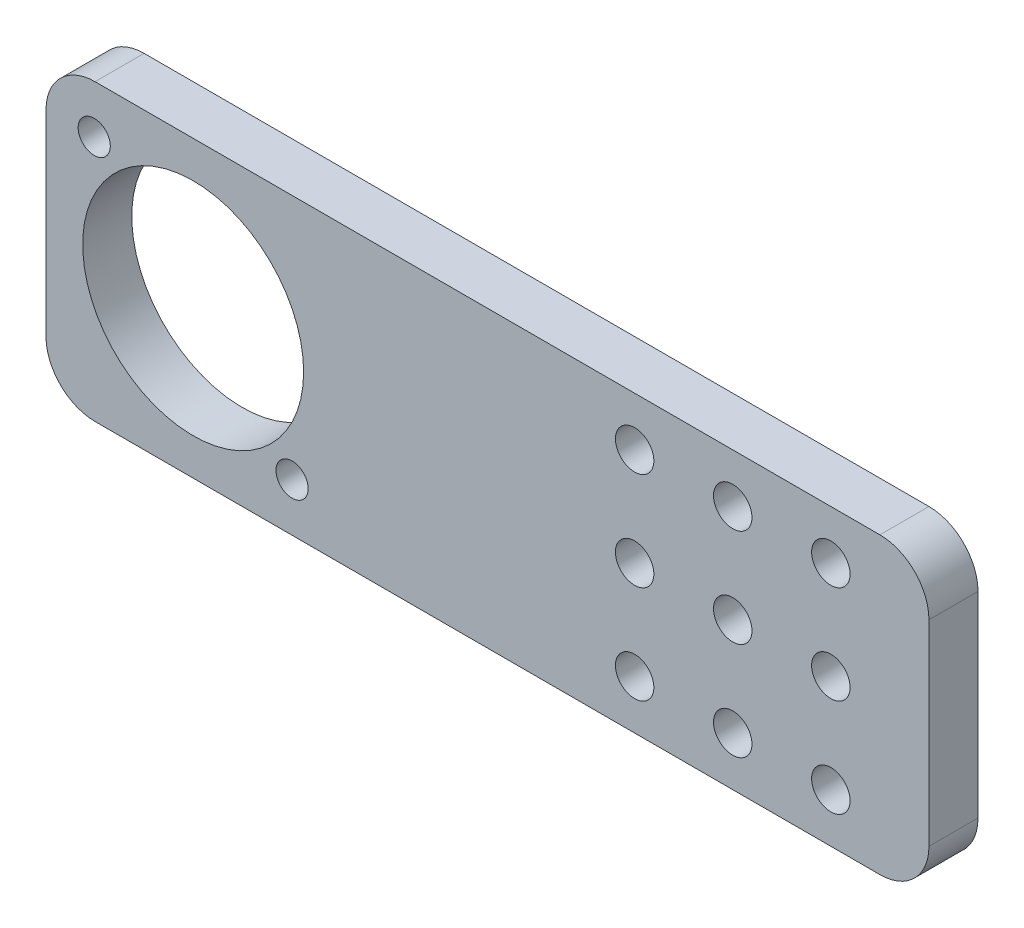
ISO-10303-21;
HEADER;
FILE_DESCRIPTION(('STEP AP214'),'2;1');
FILE_NAME('part.step','',(''),(''),'','','');
FILE_SCHEMA(('AUTOMOTIVE_DESIGN { 1 0 10303 214 1 1 1 1 }'));
ENDSEC;
DATA;
#1=APPLICATION_CONTEXT('core data for automotive mechanical design processes');
#2=APPLICATION_PROTOCOL_DEFINITION('international standard','automotive_design',2000,#1);
#3=PRODUCT_CONTEXT('',#1,'mechanical');
#4=PRODUCT('Part','Part','',(#3));
#5=PRODUCT_RELATED_PRODUCT_CATEGORY('part','',(#4));
#6=PRODUCT_DEFINITION_FORMATION('','',#4);
#7=PRODUCT_DEFINITION_CONTEXT('part definition',#1,'design');
#8=PRODUCT_DEFINITION('design','',#6,#7);
#9=PRODUCT_DEFINITION_SHAPE('','',#8);
#10=(LENGTH_UNIT() NAMED_UNIT(*) SI_UNIT(.MILLI.,.METRE.));
#11=(NAMED_UNIT(*) PLANE_ANGLE_UNIT() SI_UNIT($,.RADIAN.));
#12=(NAMED_UNIT(*) SI_UNIT($,.STERADIAN.) SOLID_ANGLE_UNIT());
#13=UNCERTAINTY_MEASURE_WITH_UNIT(LENGTH_MEASURE(1.E-05),#10,'distance_accuracy_value','');
#14=(GEOMETRIC_REPRESENTATION_CONTEXT(3) GLOBAL_UNCERTAINTY_ASSIGNED_CONTEXT((#13)) GLOBAL_UNIT_ASSIGNED_CONTEXT((#10,
#11,#12)) REPRESENTATION_CONTEXT('',''));
#15=CARTESIAN_POINT('',(0.,0.,0.));
#16=DIRECTION('',(0.,0.,1.));
#17=DIRECTION('',(1.,0.,0.));
#18=AXIS2_PLACEMENT_3D('',#15,#16,#17);
#19=CARTESIAN_POINT('',(-57.15,1159.64261389653,6.35000000000018));
#20=DIRECTION('',(0.,0.,1.));
#21=DIRECTION('',(1.,0.,0.));
#22=AXIS2_PLACEMENT_3D('',#19,#20,#21);
#23=PLANE('',#22);
#24=CARTESIAN_POINT('',(-95.25,1159.64261389653,6.35000000000018));
#25=DIRECTION('',(0.,0.,-1.));
#26=DIRECTION('',(-1.,0.,0.));
#27=AXIS2_PLACEMENT_3D('',#24,#25,#26);
#28=CIRCLE('',#27,14.3002);
#29=CARTESIAN_POINT('',(-80.9498,1159.64261389653,6.35000000000018));
#30=VERTEX_POINT('',#29);
#31=EDGE_CURVE('E272',#30,#30,#28,.T.);
#32=ORIENTED_EDGE('',*,*,#31,.T.);
#33=EDGE_LOOP('',(#32));
#34=FACE_BOUND('',#33,.T.);
#35=CARTESIAN_POINT('',(-108.055845228645,1172.44845912518,6.35000000000018));
#36=DIRECTION('',(0.,0.,-1.));
#37=DIRECTION('',(-1.,0.,0.));
#38=AXIS2_PLACEMENT_3D('',#35,#36,#37);
#39=CIRCLE('',#38,2.0828);
#40=CARTESIAN_POINT('',(-105.973045228645,1172.44845912518,6.35000000000018));
#41=VERTEX_POINT('',#40);
#42=EDGE_CURVE('E271',#41,#41,#39,.T.);
#43=ORIENTED_EDGE('',*,*,#42,.T.);
#44=EDGE_LOOP('',(#43));
#45=FACE_BOUND('',#44,.T.);
#46=CARTESIAN_POINT('',(-82.4441547713553,1146.83676866789,6.35000000000018));
#47=DIRECTION('',(0.,0.,-1.));
#48=DIRECTION('',(-1.,0.,0.));
#49=AXIS2_PLACEMENT_3D('',#46,#47,#48);
#50=CIRCLE('',#49,2.0828);
#51=CARTESIAN_POINT('',(-80.3613547713553,1146.83676866789,6.35000000000018));
#52=VERTEX_POINT('',#51);
#53=EDGE_CURVE('E379',#52,#52,#50,.T.);
#54=ORIENTED_EDGE('',*,*,#53,.T.);
#55=EDGE_LOOP('',(#54));
#56=FACE_BOUND('',#55,.T.);
#57=CARTESIAN_POINT('',(-38.1,1159.64261389653,6.35000000000018));
#58=DIRECTION('',(0.,0.,-1.));
#59=DIRECTION('',(1.,0.,0.));
#60=AXIS2_PLACEMENT_3D('',#57,#58,#59);
#61=CIRCLE('',#60,2.4892);
#62=CARTESIAN_POINT('',(-40.5892,1159.64261389653,6.35000000000018));
#63=VERTEX_POINT('',#62);
#64=EDGE_CURVE('E409',#63,#63,#61,.T.);
#65=ORIENTED_EDGE('',*,*,#64,.T.);
#66=EDGE_LOOP('',(#65));
#67=FACE_BOUND('',#66,.T.);
#68=CARTESIAN_POINT('',(-38.1,1146.94261389653,6.35000000000018));
#69=DIRECTION('',(0.,0.,-1.));
#70=DIRECTION('',(1.,0.,0.));
#71=AXIS2_PLACEMENT_3D('',#68,#69,#70);
#72=CIRCLE('',#71,2.4892);
#73=CARTESIAN_POINT('',(-40.5892,1146.94261389653,6.35000000000018));
#74=VERTEX_POINT('',#73);
#75=EDGE_CURVE('E237',#74,#74,#72,.T.);
#76=ORIENTED_EDGE('',*,*,#75,.T.);
#77=EDGE_LOOP('',(#76));
#78=FACE_BOUND('',#77,.T.);
#79=CARTESIAN_POINT('',(-25.4,1146.94261389653,6.35000000000018));
#80=DIRECTION('',(0.,0.,-1.));
#81=DIRECTION('',(1.,0.,0.));
#82=AXIS2_PLACEMENT_3D('',#79,#80,#81);
#83=CIRCLE('',#82,2.4892);
#84=CARTESIAN_POINT('',(-27.8892,1146.94261389653,6.35000000000018));
#85=VERTEX_POINT('',#84);
#86=EDGE_CURVE('E238',#85,#85,#83,.T.);
#87=ORIENTED_EDGE('',*,*,#86,.T.);
#88=EDGE_LOOP('',(#87));
#89=FACE_BOUND('',#88,.T.);
#90=CARTESIAN_POINT('',(-25.4,1172.34261389653,6.35000000000018));
#91=DIRECTION('',(0.,0.,-1.));
#92=DIRECTION('',(1.,0.,0.));
#93=AXIS2_PLACEMENT_3D('',#90,#91,#92);
#94=CIRCLE('',#93,2.4892);
#95=CARTESIAN_POINT('',(-27.8892,1172.34261389653,6.35000000000018));
#96=VERTEX_POINT('',#95);
#97=EDGE_CURVE('E353',#96,#96,#94,.T.);
#98=ORIENTED_EDGE('',*,*,#97,.T.);
#99=EDGE_LOOP('',(#98));
#100=FACE_BOUND('',#99,.T.);
#101=CARTESIAN_POINT('',(-25.4,1159.64261389653,6.35000000000018));
#102=DIRECTION('',(0.,0.,-1.));
#103=DIRECTION('',(1.,0.,0.));
#104=AXIS2_PLACEMENT_3D('',#101,#102,#103);
#105=CIRCLE('',#104,2.4892);
#106=CARTESIAN_POINT('',(-27.8892,1159.64261389653,6.35000000000018));
#107=VERTEX_POINT('',#106);
#108=EDGE_CURVE('E254',#107,#107,#105,.T.);
#109=ORIENTED_EDGE('',*,*,#108,.T.);
#110=EDGE_LOOP('',(#109));
#111=FACE_BOUND('',#110,.T.);
#112=CARTESIAN_POINT('',(-38.1,1172.34261389653,6.35000000000018));
#113=DIRECTION('',(0.,0.,-1.));
#114=DIRECTION('',(1.,0.,0.));
#115=AXIS2_PLACEMENT_3D('',#112,#113,#114);
#116=CIRCLE('',#115,2.4892);
#117=CARTESIAN_POINT('',(-40.5892,1172.34261389653,6.35000000000018));
#118=VERTEX_POINT('',#117);
#119=EDGE_CURVE('E329',#118,#118,#116,.T.);
#120=ORIENTED_EDGE('',*,*,#119,.T.);
#121=EDGE_LOOP('',(#120));
#122=FACE_BOUND('',#121,.T.);
#123=CARTESIAN_POINT('',(-12.6999999999998,1146.94261389653,6.35000000000018));
#124=DIRECTION('',(0.,0.,-1.));
#125=DIRECTION('',(1.,0.,0.));
#126=AXIS2_PLACEMENT_3D('',#123,#124,#125);
#127=CIRCLE('',#126,2.4892);
#128=CARTESIAN_POINT('',(-15.1892,1146.94261389653,6.35000000000018));
#129=VERTEX_POINT('',#128);
#130=EDGE_CURVE('E330',#129,#129,#127,.T.);
#131=ORIENTED_EDGE('',*,*,#130,.T.);
#132=EDGE_LOOP('',(#131));
#133=FACE_BOUND('',#132,.T.);
#134=CARTESIAN_POINT('',(-12.6999999999999,1172.34261389653,6.35000000000018));
#135=DIRECTION('',(0.,0.,-1.));
#136=DIRECTION('',(1.,0.,0.));
#137=AXIS2_PLACEMENT_3D('',#134,#135,#136);
#138=CIRCLE('',#137,2.4892);
#139=CARTESIAN_POINT('',(-15.1892,1172.34261389653,6.35000000000018));
#140=VERTEX_POINT('',#139);
#141=EDGE_CURVE('E296',#140,#140,#138,.T.);
#142=ORIENTED_EDGE('',*,*,#141,.T.);
#143=EDGE_LOOP('',(#142));
#144=FACE_BOUND('',#143,.T.);
#145=CARTESIAN_POINT('',(-12.6999999999999,1159.64261389653,6.35000000000018));
#146=DIRECTION('',(0.,0.,-1.));
#147=DIRECTION('',(1.,0.,0.));
#148=AXIS2_PLACEMENT_3D('',#145,#146,#147);
#149=CIRCLE('',#148,2.4892);
#150=CARTESIAN_POINT('',(-15.1892,1159.64261389653,6.35000000000018));
#151=VERTEX_POINT('',#150);
#152=EDGE_CURVE('E383',#151,#151,#149,.T.);
#153=ORIENTED_EDGE('',*,*,#152,.T.);
#154=EDGE_LOOP('',(#153));
#155=FACE_BOUND('',#154,.T.);
#156=CARTESIAN_POINT('',(-6.34999999999985,1146.94261389653,6.35000000000018));
#157=DIRECTION('',(0.,0.,-1.));
#158=DIRECTION('',(0.707106781186552,-0.707106781186543,0.));
#159=AXIS2_PLACEMENT_3D('',#156,#157,#158);
#160=CIRCLE('',#159,6.35);
#161=CARTESIAN_POINT('',(1.39115793291948E-13,1146.94261389653,6.35000000000018));
#162=VERTEX_POINT('',#161);
#163=CARTESIAN_POINT('',(-6.34999999999985,1140.59261389653,6.35000000000018));
#164=VERTEX_POINT('',#163);
#165=EDGE_CURVE('E219',#162,#164,#160,.T.);
#166=ORIENTED_EDGE('',*,*,#165,.F.);
#167=DIRECTION('',(0.,1.,0.));
#168=VECTOR('',#167,1.);
#169=CARTESIAN_POINT('',(1.40848710871646E-13,1140.59261389653,6.35000000000018));
#170=LINE('',#169,#168);
#171=CARTESIAN_POINT('',(1.32184122973154E-13,1172.34261389653,6.35000000000018));
#172=VERTEX_POINT('',#171);
#173=EDGE_CURVE('E201',#162,#172,#170,.T.);
#174=ORIENTED_EDGE('',*,*,#173,.T.);
#175=CARTESIAN_POINT('',(-6.34999999999987,1172.34261389653,6.35000000000018));
#176=DIRECTION('',(0.,0.,-1.));
#177=DIRECTION('',(0.707106781186537,0.707106781186558,0.));
#178=AXIS2_PLACEMENT_3D('',#175,#176,#177);
#179=CIRCLE('',#178,6.35);
#180=CARTESIAN_POINT('',(-6.34999999999987,1178.69261389653,6.35000000000018));
#181=VERTEX_POINT('',#180);
#182=EDGE_CURVE('E321',#181,#172,#179,.T.);
#183=ORIENTED_EDGE('',*,*,#182,.F.);
#184=DIRECTION('',(-1.,0.,0.));
#185=VECTOR('',#184,1.);
#186=CARTESIAN_POINT('',(1.30451205393456E-13,1178.69261389653,6.35000000000018));
#187=LINE('',#186,#185);
#188=CARTESIAN_POINT('',(-107.95,1178.69261389653,6.35000000000018));
#189=VERTEX_POINT('',#188);
#190=EDGE_CURVE('E239',#181,#189,#187,.T.);
#191=ORIENTED_EDGE('',*,*,#190,.T.);
#192=CARTESIAN_POINT('',(-107.95,1172.34261389653,6.35000000000018));
#193=DIRECTION('',(0.,0.,-1.));
#194=DIRECTION('',(-0.707106781186553,0.707106781186542,0.));
#195=AXIS2_PLACEMENT_3D('',#192,#193,#194);
#196=CIRCLE('',#195,6.35);
#197=CARTESIAN_POINT('',(-114.3,1172.34261389653,6.35000000000018));
#198=VERTEX_POINT('',#197);
#199=EDGE_CURVE('E243',#198,#189,#196,.T.);
#200=ORIENTED_EDGE('',*,*,#199,.F.);
#201=DIRECTION('',(0.,-1.,0.));
#202=VECTOR('',#201,1.);
#203=CARTESIAN_POINT('',(-114.3,1178.69261389653,6.35000000000018));
#204=LINE('',#203,#202);
#205=CARTESIAN_POINT('',(-114.3,1146.94261389653,6.35000000000018));
#206=VERTEX_POINT('',#205);
#207=EDGE_CURVE('E369',#198,#206,#204,.T.);
#208=ORIENTED_EDGE('',*,*,#207,.T.);
#209=CARTESIAN_POINT('',(-107.95,1146.94261389653,6.35000000000018));
#210=DIRECTION('',(0.,0.,-1.));
#211=DIRECTION('',(-0.707106781186536,-0.707106781186559,0.));
#212=AXIS2_PLACEMENT_3D('',#209,#210,#211);
#213=CIRCLE('',#212,6.35);
#214=CARTESIAN_POINT('',(-107.95,1140.59261389653,6.35000000000018));
#215=VERTEX_POINT('',#214);
#216=EDGE_CURVE('E373',#215,#206,#213,.T.);
#217=ORIENTED_EDGE('',*,*,#216,.F.);
#218=DIRECTION('',(1.,0.,0.));
#219=VECTOR('',#218,1.);
#220=CARTESIAN_POINT('',(-114.3,1140.59261389653,6.35000000000018));
#221=LINE('',#220,#219);
#222=EDGE_CURVE('E11',#215,#164,#221,.T.);
#223=ORIENTED_EDGE('',*,*,#222,.T.);
#224=EDGE_LOOP('',(#166,#174,#183,#191,#200,#208,#217,#223));
#225=FACE_BOUND('',#224,.T.);
#226=ADVANCED_FACE('F17',(#34,#45,#56,#67,#78,#89,#100,#111,#122,#133,#144,#155,#225),#23,.T.);
#227=CARTESIAN_POINT('',(-114.3,1140.59261389653,1.70974345792274E-13));
#228=DIRECTION('',(0.,-1.,0.));
#229=DIRECTION('',(0.,0.,-1.));
#230=AXIS2_PLACEMENT_3D('',#227,#228,#229);
#231=PLANE('',#230);
#232=DIRECTION('',(0.,0.,-1.));
#233=VECTOR('',#232,1.);
#234=CARTESIAN_POINT('',(-6.34999999999985,1140.59261389653,1.70974345792274E-13));
#235=LINE('',#234,#233);
#236=CARTESIAN_POINT('',(-6.34999999999985,1140.59261389653,1.70974345792274E-13));
#237=VERTEX_POINT('',#236);
#238=EDGE_CURVE('E228',#164,#237,#235,.T.);
#239=ORIENTED_EDGE('',*,*,#238,.F.);
#240=ORIENTED_EDGE('',*,*,#222,.F.);
#241=DIRECTION('',(0.,0.,1.));
#242=VECTOR('',#241,1.);
#243=CARTESIAN_POINT('',(-107.95,1140.59261389653,1.70974345792274E-13));
#244=LINE('',#243,#242);
#245=CARTESIAN_POINT('',(-107.95,1140.59261389653,1.70974345792274E-13));
#246=VERTEX_POINT('',#245);
#247=EDGE_CURVE('E376',#246,#215,#244,.T.);
#248=ORIENTED_EDGE('',*,*,#247,.F.);
#249=DIRECTION('',(1.,0.,0.));
#250=VECTOR('',#249,1.);
#251=CARTESIAN_POINT('',(-114.3,1140.59261389653,1.70974345792274E-13));
#252=LINE('',#251,#250);
#253=EDGE_CURVE('E213',#246,#237,#252,.T.);
#254=ORIENTED_EDGE('',*,*,#253,.T.);
#255=EDGE_LOOP('',(#239,#240,#248,#254));
#256=FACE_BOUND('',#255,.T.);
#257=ADVANCED_FACE('F454',(#256),#231,.T.);
#258=CARTESIAN_POINT('',(-82.4441547713553,1146.83676866789,1.70974345792274E-13));
#259=DIRECTION('',(0.,0.,1.));
#260=DIRECTION('',(-1.,0.,0.));
#261=AXIS2_PLACEMENT_3D('',#258,#259,#260);
#262=CYLINDRICAL_SURFACE('',#261,2.0828);
#263=ORIENTED_EDGE('',*,*,#53,.F.);
#264=DIRECTION('',(0.,0.,-1.));
#265=VECTOR('',#264,1.);
#266=CARTESIAN_POINT('',(-80.3613547713553,1146.83676866789,1.70974345792274E-13));
#267=LINE('',#266,#265);
#268=CARTESIAN_POINT('',(-80.3613547713553,1146.83676866789,1.70974345792274E-13));
#269=VERTEX_POINT('',#268);
#270=EDGE_CURVE('E25',#52,#269,#267,.T.);
#271=ORIENTED_EDGE('',*,*,#270,.T.);
#272=CARTESIAN_POINT('',(-82.4441547713553,1146.83676866789,1.70974345792274E-13));
#273=DIRECTION('',(0.,0.,-1.));
#274=DIRECTION('',(-1.,0.,0.));
#275=AXIS2_PLACEMENT_3D('',#272,#273,#274);
#276=CIRCLE('',#275,2.0828);
#277=EDGE_CURVE('E338',#269,#269,#276,.T.);
#278=ORIENTED_EDGE('',*,*,#277,.T.);
#279=ORIENTED_EDGE('',*,*,#270,.F.);
#280=EDGE_LOOP('',(#263,#271,#278,#279));
#281=FACE_BOUND('',#280,.T.);
#282=ADVANCED_FACE('F424',(#281),#262,.F.);
#283=CARTESIAN_POINT('',(-108.055845228645,1172.44845912518,1.70974345792274E-13));
#284=DIRECTION('',(0.,0.,1.));
#285=DIRECTION('',(-1.,0.,0.));
#286=AXIS2_PLACEMENT_3D('',#283,#284,#285);
#287=CYLINDRICAL_SURFACE('',#286,2.0828);
#288=ORIENTED_EDGE('',*,*,#42,.F.);
#289=DIRECTION('',(0.,0.,-1.));
#290=VECTOR('',#289,1.);
#291=CARTESIAN_POINT('',(-105.973045228645,1172.44845912518,1.70974345792274E-13));
#292=LINE('',#291,#290);
#293=CARTESIAN_POINT('',(-105.973045228645,1172.44845912518,1.70974345792274E-13));
#294=VERTEX_POINT('',#293);
#295=EDGE_CURVE('E46',#41,#294,#292,.T.);
#296=ORIENTED_EDGE('',*,*,#295,.T.);
#297=CARTESIAN_POINT('',(-108.055845228645,1172.44845912518,1.70974345792274E-13));
#298=DIRECTION('',(0.,0.,-1.));
#299=DIRECTION('',(-1.,0.,0.));
#300=AXIS2_PLACEMENT_3D('',#297,#298,#299);
#301=CIRCLE('',#300,2.0828);
#302=EDGE_CURVE('E341',#294,#294,#301,.T.);
#303=ORIENTED_EDGE('',*,*,#302,.T.);
#304=ORIENTED_EDGE('',*,*,#295,.F.);
#305=EDGE_LOOP('',(#288,#296,#303,#304));
#306=FACE_BOUND('',#305,.T.);
#307=ADVANCED_FACE('F488',(#306),#287,.F.);
#308=CARTESIAN_POINT('',(-95.25,1159.64261389653,1.70974345792274E-13));
#309=DIRECTION('',(0.,0.,1.));
#310=DIRECTION('',(-1.,0.,0.));
#311=AXIS2_PLACEMENT_3D('',#308,#309,#310);
#312=CYLINDRICAL_SURFACE('',#311,14.3002);
#313=ORIENTED_EDGE('',*,*,#31,.F.);
#314=DIRECTION('',(0.,0.,-1.));
#315=VECTOR('',#314,1.);
#316=CARTESIAN_POINT('',(-80.9498,1159.64261389653,1.70974345792274E-13));
#317=LINE('',#316,#315);
#318=CARTESIAN_POINT('',(-80.9498,1159.64261389653,1.70974345792274E-13));
#319=VERTEX_POINT('',#318);
#320=EDGE_CURVE('E268',#30,#319,#317,.T.);
#321=ORIENTED_EDGE('',*,*,#320,.T.);
#322=CARTESIAN_POINT('',(-95.25,1159.64261389653,1.70974345792274E-13));
#323=DIRECTION('',(0.,0.,-1.));
#324=DIRECTION('',(-1.,0.,0.));
#325=AXIS2_PLACEMENT_3D('',#322,#323,#324);
#326=CIRCLE('',#325,14.3002);
#327=EDGE_CURVE('E344',#319,#319,#326,.T.);
#328=ORIENTED_EDGE('',*,*,#327,.T.);
#329=ORIENTED_EDGE('',*,*,#320,.F.);
#330=EDGE_LOOP('',(#313,#321,#328,#329));
#331=FACE_BOUND('',#330,.T.);
#332=ADVANCED_FACE('F492',(#331),#312,.F.);
#333=CARTESIAN_POINT('',(-38.1,1159.64261389653,6.35000000000018));
#334=DIRECTION('',(0.,0.,-1.));
#335=DIRECTION('',(1.,0.,0.));
#336=AXIS2_PLACEMENT_3D('',#333,#334,#335);
#337=CYLINDRICAL_SURFACE('',#336,2.4892);
#338=ORIENTED_EDGE('',*,*,#64,.F.);
#339=DIRECTION('',(0.,0.,-1.));
#340=VECTOR('',#339,1.);
#341=CARTESIAN_POINT('',(-40.5892,1159.64261389653,6.35000000000018));
#342=LINE('',#341,#340);
#343=CARTESIAN_POINT('',(-40.5892,1159.64261389653,1.70974345792274E-13));
#344=VERTEX_POINT('',#343);
#345=EDGE_CURVE('E413',#63,#344,#342,.T.);
#346=ORIENTED_EDGE('',*,*,#345,.T.);
#347=CARTESIAN_POINT('',(-38.1,1159.64261389653,1.70974345792274E-13));
#348=DIRECTION('',(0.,0.,1.));
#349=DIRECTION('',(1.,0.,0.));
#350=AXIS2_PLACEMENT_3D('',#347,#348,#349);
#351=CIRCLE('',#350,2.4892);
#352=EDGE_CURVE('E334',#344,#344,#351,.T.);
#353=ORIENTED_EDGE('',*,*,#352,.F.);
#354=ORIENTED_EDGE('',*,*,#345,.F.);
#355=EDGE_LOOP('',(#338,#346,#353,#354));
#356=FACE_BOUND('',#355,.T.);
#357=ADVANCED_FACE('F499',(#356),#337,.F.);
#358=CARTESIAN_POINT('',(-38.1,1146.94261389653,6.35000000000018));
#359=DIRECTION('',(0.,0.,-1.));
#360=DIRECTION('',(1.,0.,0.));
#361=AXIS2_PLACEMENT_3D('',#358,#359,#360);
#362=CYLINDRICAL_SURFACE('',#361,2.4892);
#363=ORIENTED_EDGE('',*,*,#75,.F.);
#364=DIRECTION('',(0.,0.,-1.));
#365=VECTOR('',#364,1.);
#366=CARTESIAN_POINT('',(-40.5892,1146.94261389653,6.35000000000018));
#367=LINE('',#366,#365);
#368=CARTESIAN_POINT('',(-40.5892,1146.94261389653,1.70974345792274E-13));
#369=VERTEX_POINT('',#368);
#370=EDGE_CURVE('E366',#74,#369,#367,.T.);
#371=ORIENTED_EDGE('',*,*,#370,.T.);
#372=CARTESIAN_POINT('',(-38.1,1146.94261389653,1.70974345792274E-13));
#373=DIRECTION('',(0.,0.,1.));
#374=DIRECTION('',(1.,0.,0.));
#375=AXIS2_PLACEMENT_3D('',#372,#373,#374);
#376=CIRCLE('',#375,2.4892);
#377=EDGE_CURVE('E325',#369,#369,#376,.T.);
#378=ORIENTED_EDGE('',*,*,#377,.F.);
#379=ORIENTED_EDGE('',*,*,#370,.F.);
#380=EDGE_LOOP('',(#363,#371,#378,#379));
#381=FACE_BOUND('',#380,.T.);
#382=ADVANCED_FACE('F506',(#381),#362,.F.);
#383=CARTESIAN_POINT('',(-25.4,1146.94261389653,6.35000000000018));
#384=DIRECTION('',(0.,0.,-1.));
#385=DIRECTION('',(1.,0.,0.));
#386=AXIS2_PLACEMENT_3D('',#383,#384,#385);
#387=CYLINDRICAL_SURFACE('',#386,2.4892);
#388=ORIENTED_EDGE('',*,*,#86,.F.);
#389=DIRECTION('',(0.,0.,-1.));
#390=VECTOR('',#389,1.);
#391=CARTESIAN_POINT('',(-27.8892,1146.94261389653,6.35000000000018));
#392=LINE('',#391,#390);
#393=CARTESIAN_POINT('',(-27.8892,1146.94261389653,1.70974345792274E-13));
#394=VERTEX_POINT('',#393);
#395=EDGE_CURVE('E235',#85,#394,#392,.T.);
#396=ORIENTED_EDGE('',*,*,#395,.T.);
#397=CARTESIAN_POINT('',(-25.4,1146.94261389653,1.70974345792274E-13));
#398=DIRECTION('',(0.,0.,1.));
#399=DIRECTION('',(1.,0.,0.));
#400=AXIS2_PLACEMENT_3D('',#397,#398,#399);
#401=CIRCLE('',#400,2.4892);
#402=EDGE_CURVE('E316',#394,#394,#401,.T.);
#403=ORIENTED_EDGE('',*,*,#402,.F.);
#404=ORIENTED_EDGE('',*,*,#395,.F.);
#405=EDGE_LOOP('',(#388,#396,#403,#404));
#406=FACE_BOUND('',#405,.T.);
#407=ADVANCED_FACE('F512',(#406),#387,.F.);
#408=CARTESIAN_POINT('',(-25.4,1172.34261389653,6.35000000000018));
#409=DIRECTION('',(0.,0.,-1.));
#410=DIRECTION('',(1.,0.,0.));
#411=AXIS2_PLACEMENT_3D('',#408,#409,#410);
#412=CYLINDRICAL_SURFACE('',#411,2.4892);
#413=ORIENTED_EDGE('',*,*,#97,.F.);
#414=DIRECTION('',(0.,0.,-1.));
#415=VECTOR('',#414,1.);
#416=CARTESIAN_POINT('',(-27.8892,1172.34261389653,6.35000000000018));
#417=LINE('',#416,#415);
#418=CARTESIAN_POINT('',(-27.8892,1172.34261389653,1.70974345792274E-13));
#419=VERTEX_POINT('',#418);
#420=EDGE_CURVE('E350',#96,#419,#417,.T.);
#421=ORIENTED_EDGE('',*,*,#420,.T.);
#422=CARTESIAN_POINT('',(-25.4,1172.34261389653,1.70974345792274E-13));
#423=DIRECTION('',(0.,0.,1.));
#424=DIRECTION('',(1.,0.,0.));
#425=AXIS2_PLACEMENT_3D('',#422,#423,#424);
#426=CIRCLE('',#425,2.4892);
#427=EDGE_CURVE('E289',#419,#419,#426,.T.);
#428=ORIENTED_EDGE('',*,*,#427,.F.);
#429=ORIENTED_EDGE('',*,*,#420,.F.);
#430=EDGE_LOOP('',(#413,#421,#428,#429));
#431=FACE_BOUND('',#430,.T.);
#432=ADVANCED_FACE('F508',(#431),#412,.F.);
#433=CARTESIAN_POINT('',(-25.4,1159.64261389653,6.35000000000018));
#434=DIRECTION('',(0.,0.,-1.));
#435=DIRECTION('',(1.,0.,0.));
#436=AXIS2_PLACEMENT_3D('',#433,#434,#435);
#437=CYLINDRICAL_SURFACE('',#436,2.4892);
#438=ORIENTED_EDGE('',*,*,#108,.F.);
#439=DIRECTION('',(0.,0.,-1.));
#440=VECTOR('',#439,1.);
#441=CARTESIAN_POINT('',(-27.8892,1159.64261389653,6.35000000000018));
#442=LINE('',#441,#440);
#443=CARTESIAN_POINT('',(-27.8892,1159.64261389653,1.70974345792274E-13));
#444=VERTEX_POINT('',#443);
#445=EDGE_CURVE('E258',#107,#444,#442,.T.);
#446=ORIENTED_EDGE('',*,*,#445,.T.);
#447=CARTESIAN_POINT('',(-25.4,1159.64261389653,1.70974345792274E-13));
#448=DIRECTION('',(0.,0.,1.));
#449=DIRECTION('',(1.,0.,0.));
#450=AXIS2_PLACEMENT_3D('',#447,#448,#449);
#451=CIRCLE('',#450,2.4892);
#452=EDGE_CURVE('E285',#444,#444,#451,.T.);
#453=ORIENTED_EDGE('',*,*,#452,.F.);
#454=ORIENTED_EDGE('',*,*,#445,.F.);
#455=EDGE_LOOP('',(#438,#446,#453,#454));
#456=FACE_BOUND('',#455,.T.);
#457=ADVANCED_FACE('F511',(#456),#437,.F.);
#458=CARTESIAN_POINT('',(-38.1,1172.34261389653,6.35000000000018));
#459=DIRECTION('',(0.,0.,-1.));
#460=DIRECTION('',(1.,0.,0.));
#461=AXIS2_PLACEMENT_3D('',#458,#459,#460);
#462=CYLINDRICAL_SURFACE('',#461,2.4892);
#463=ORIENTED_EDGE('',*,*,#119,.F.);
#464=DIRECTION('',(0.,0.,-1.));
#465=VECTOR('',#464,1.);
#466=CARTESIAN_POINT('',(-40.5892,1172.34261389653,6.35000000000018));
#467=LINE('',#466,#465);
#468=CARTESIAN_POINT('',(-40.5892,1172.34261389653,1.70974345792274E-13));
#469=VERTEX_POINT('',#468);
#470=EDGE_CURVE('E259',#118,#469,#467,.T.);
#471=ORIENTED_EDGE('',*,*,#470,.T.);
#472=CARTESIAN_POINT('',(-38.1,1172.34261389653,1.70974345792274E-13));
#473=DIRECTION('',(0.,0.,1.));
#474=DIRECTION('',(1.,0.,0.));
#475=AXIS2_PLACEMENT_3D('',#472,#473,#474);
#476=CIRCLE('',#475,2.4892);
#477=EDGE_CURVE('E290',#469,#469,#476,.T.);
#478=ORIENTED_EDGE('',*,*,#477,.F.);
#479=ORIENTED_EDGE('',*,*,#470,.F.);
#480=EDGE_LOOP('',(#463,#471,#478,#479));
#481=FACE_BOUND('',#480,.T.);
#482=ADVANCED_FACE('F521',(#481),#462,.F.);
#483=CARTESIAN_POINT('',(-12.6999999999998,1146.94261389653,6.35000000000018));
#484=DIRECTION('',(0.,0.,-1.));
#485=DIRECTION('',(1.,0.,0.));
#486=AXIS2_PLACEMENT_3D('',#483,#484,#485);
#487=CYLINDRICAL_SURFACE('',#486,2.4892);
#488=ORIENTED_EDGE('',*,*,#130,.F.);
#489=DIRECTION('',(0.,0.,-1.));
#490=VECTOR('',#489,1.);
#491=CARTESIAN_POINT('',(-15.1892,1146.94261389653,6.35000000000018));
#492=LINE('',#491,#490);
#493=CARTESIAN_POINT('',(-15.1892,1146.94261389653,1.70974345792274E-13));
#494=VERTEX_POINT('',#493);
#495=EDGE_CURVE('E326',#129,#494,#492,.T.);
#496=ORIENTED_EDGE('',*,*,#495,.T.);
#497=CARTESIAN_POINT('',(-12.6999999999998,1146.94261389653,1.70974345792274E-13));
#498=DIRECTION('',(0.,0.,1.));
#499=DIRECTION('',(1.,0.,0.));
#500=AXIS2_PLACEMENT_3D('',#497,#498,#499);
#501=CIRCLE('',#500,2.4892);
#502=EDGE_CURVE('E295',#494,#494,#501,.T.);
#503=ORIENTED_EDGE('',*,*,#502,.F.);
#504=ORIENTED_EDGE('',*,*,#495,.F.);
#505=EDGE_LOOP('',(#488,#496,#503,#504));
#506=FACE_BOUND('',#505,.T.);
#507=ADVANCED_FACE('F517',(#506),#487,.F.);
#508=CARTESIAN_POINT('',(-12.6999999999999,1172.34261389653,6.35000000000018));
#509=DIRECTION('',(0.,0.,-1.));
#510=DIRECTION('',(1.,0.,0.));
#511=AXIS2_PLACEMENT_3D('',#508,#509,#510);
#512=CYLINDRICAL_SURFACE('',#511,2.4892);
#513=ORIENTED_EDGE('',*,*,#141,.F.);
#514=DIRECTION('',(0.,0.,-1.));
#515=VECTOR('',#514,1.);
#516=CARTESIAN_POINT('',(-15.1892,1172.34261389653,6.35000000000018));
#517=LINE('',#516,#515);
#518=CARTESIAN_POINT('',(-15.1892,1172.34261389653,1.70974345792274E-13));
#519=VERTEX_POINT('',#518);
#520=EDGE_CURVE('E300',#140,#519,#517,.T.);
#521=ORIENTED_EDGE('',*,*,#520,.T.);
#522=CARTESIAN_POINT('',(-12.6999999999999,1172.34261389653,1.70974345792274E-13));
#523=DIRECTION('',(0.,0.,1.));
#524=DIRECTION('',(1.,0.,0.));
#525=AXIS2_PLACEMENT_3D('',#522,#523,#524);
#526=CIRCLE('',#525,2.4892);
#527=EDGE_CURVE('E291',#519,#519,#526,.T.);
#528=ORIENTED_EDGE('',*,*,#527,.F.);
#529=ORIENTED_EDGE('',*,*,#520,.F.);
#530=EDGE_LOOP('',(#513,#521,#528,#529));
#531=FACE_BOUND('',#530,.T.);
#532=ADVANCED_FACE('F520',(#531),#512,.F.);
#533=CARTESIAN_POINT('',(-12.6999999999999,1159.64261389653,6.35000000000018));
#534=DIRECTION('',(0.,0.,-1.));
#535=DIRECTION('',(1.,0.,0.));
#536=AXIS2_PLACEMENT_3D('',#533,#534,#535);
#537=CYLINDRICAL_SURFACE('',#536,2.4892);
#538=ORIENTED_EDGE('',*,*,#152,.F.);
#539=DIRECTION('',(0.,0.,-1.));
#540=VECTOR('',#539,1.);
#541=CARTESIAN_POINT('',(-15.1892,1159.64261389653,6.35000000000018));
#542=LINE('',#541,#540);
#543=CARTESIAN_POINT('',(-15.1892,1159.64261389653,1.70974345792274E-13));
#544=VERTEX_POINT('',#543);
#545=EDGE_CURVE('E301',#151,#544,#542,.T.);
#546=ORIENTED_EDGE('',*,*,#545,.T.);
#547=CARTESIAN_POINT('',(-12.6999999999999,1159.64261389653,1.70974345792274E-13));
#548=DIRECTION('',(0.,0.,1.));
#549=DIRECTION('',(1.,0.,0.));
#550=AXIS2_PLACEMENT_3D('',#547,#548,#549);
#551=CIRCLE('',#550,2.4892);
#552=EDGE_CURVE('E281',#544,#544,#551,.T.);
#553=ORIENTED_EDGE('',*,*,#552,.F.);
#554=ORIENTED_EDGE('',*,*,#545,.F.);
#555=EDGE_LOOP('',(#538,#546,#553,#554));
#556=FACE_BOUND('',#555,.T.);
#557=ADVANCED_FACE('F525',(#556),#537,.F.);
#558=CARTESIAN_POINT('',(-107.95,1146.94261389653,1.70974345792274E-13));
#559=DIRECTION('',(0.,0.,1.));
#560=DIRECTION('',(-0.707106781186536,-0.707106781186559,0.));
#561=AXIS2_PLACEMENT_3D('',#558,#559,#560);
#562=CYLINDRICAL_SURFACE('',#561,6.35);
#563=ORIENTED_EDGE('',*,*,#216,.T.);
#564=DIRECTION('',(0.,0.,-1.));
#565=VECTOR('',#564,1.);
#566=CARTESIAN_POINT('',(-114.3,1146.94261389653,1.70974345792274E-13));
#567=LINE('',#566,#565);
#568=CARTESIAN_POINT('',(-114.3,1146.94261389653,1.70974345792274E-13));
#569=VERTEX_POINT('',#568);
#570=EDGE_CURVE('E362',#206,#569,#567,.T.);
#571=ORIENTED_EDGE('',*,*,#570,.T.);
#572=CARTESIAN_POINT('',(-107.95,1146.94261389653,1.70974345792274E-13));
#573=DIRECTION('',(0.,0.,1.));
#574=DIRECTION('',(-0.707106781186536,-0.707106781186559,0.));
#575=AXIS2_PLACEMENT_3D('',#572,#573,#574);
#576=CIRCLE('',#575,6.35);
#577=EDGE_CURVE('E249',#569,#246,#576,.T.);
#578=ORIENTED_EDGE('',*,*,#577,.T.);
#579=ORIENTED_EDGE('',*,*,#247,.T.);
#580=EDGE_LOOP('',(#563,#571,#578,#579));
#581=FACE_BOUND('',#580,.T.);
#582=ADVANCED_FACE('F456',(#581),#562,.T.);
#583=CARTESIAN_POINT('',(-114.3,1178.69261389653,1.70974345792274E-13));
#584=DIRECTION('',(-1.,0.,0.));
#585=DIRECTION('',(0.,1.,0.));
#586=AXIS2_PLACEMENT_3D('',#583,#584,#585);
#587=PLANE('',#586);
#588=DIRECTION('',(0.,0.,1.));
#589=VECTOR('',#588,1.);
#590=CARTESIAN_POINT('',(-114.3,1172.34261389653,1.70974345792274E-13));
#591=LINE('',#590,#589);
#592=CARTESIAN_POINT('',(-114.3,1172.34261389653,1.70974345792274E-13));
#593=VERTEX_POINT('',#592);
#594=EDGE_CURVE('E358',#593,#198,#591,.T.);
#595=ORIENTED_EDGE('',*,*,#594,.F.);
#596=DIRECTION('',(0.,-1.,0.));
#597=VECTOR('',#596,1.);
#598=CARTESIAN_POINT('',(-114.3,1178.69261389653,1.70974345792274E-13));
#599=LINE('',#598,#597);
#600=EDGE_CURVE('E253',#593,#569,#599,.T.);
#601=ORIENTED_EDGE('',*,*,#600,.T.);
#602=ORIENTED_EDGE('',*,*,#570,.F.);
#603=ORIENTED_EDGE('',*,*,#207,.F.);
#604=EDGE_LOOP('',(#595,#601,#602,#603));
#605=FACE_BOUND('',#604,.T.);
#606=ADVANCED_FACE('F462',(#605),#587,.T.);
#607=CARTESIAN_POINT('',(-107.95,1172.34261389653,1.70974345792274E-13));
#608=DIRECTION('',(0.,0.,1.));
#609=DIRECTION('',(-0.707106781186553,0.707106781186542,0.));
#610=AXIS2_PLACEMENT_3D('',#607,#608,#609);
#611=CYLINDRICAL_SURFACE('',#610,6.35);
#612=ORIENTED_EDGE('',*,*,#199,.T.);
#613=DIRECTION('',(0.,0.,-1.));
#614=VECTOR('',#613,1.);
#615=CARTESIAN_POINT('',(-107.95,1178.69261389653,1.70974345792274E-13));
#616=LINE('',#615,#614);
#617=CARTESIAN_POINT('',(-107.95,1178.69261389653,1.70974345792274E-13));
#618=VERTEX_POINT('',#617);
#619=EDGE_CURVE('E244',#189,#618,#616,.T.);
#620=ORIENTED_EDGE('',*,*,#619,.T.);
#621=CARTESIAN_POINT('',(-107.95,1172.34261389653,1.70974345792274E-13));
#622=DIRECTION('',(0.,0.,1.));
#623=DIRECTION('',(-0.707106781186553,0.707106781186542,0.));
#624=AXIS2_PLACEMENT_3D('',#621,#622,#623);
#625=CIRCLE('',#624,6.35);
#626=EDGE_CURVE('E267',#618,#593,#625,.T.);
#627=ORIENTED_EDGE('',*,*,#626,.T.);
#628=ORIENTED_EDGE('',*,*,#594,.T.);
#629=EDGE_LOOP('',(#612,#620,#627,#628));
#630=FACE_BOUND('',#629,.T.);
#631=ADVANCED_FACE('F465',(#630),#611,.T.);
#632=CARTESIAN_POINT('',(1.30451205393456E-13,1178.69261389653,1.70974345792274E-13));
#633=DIRECTION('',(0.,1.,0.));
#634=DIRECTION('',(1.,0.,0.));
#635=AXIS2_PLACEMENT_3D('',#632,#633,#634);
#636=PLANE('',#635);
#637=DIRECTION('',(0.,0.,1.));
#638=VECTOR('',#637,1.);
#639=CARTESIAN_POINT('',(-6.34999999999987,1178.69261389653,1.70974345792274E-13));
#640=LINE('',#639,#638);
#641=CARTESIAN_POINT('',(-6.34999999999987,1178.69261389653,1.70974345792274E-13));
#642=VERTEX_POINT('',#641);
#643=EDGE_CURVE('E317',#642,#181,#640,.T.);
#644=ORIENTED_EDGE('',*,*,#643,.F.);
#645=DIRECTION('',(-1.,0.,0.));
#646=VECTOR('',#645,1.);
#647=CARTESIAN_POINT('',(1.30451205393456E-13,1178.69261389653,1.70974345792274E-13));
#648=LINE('',#647,#646);
#649=EDGE_CURVE('E276',#642,#618,#648,.T.);
#650=ORIENTED_EDGE('',*,*,#649,.T.);
#651=ORIENTED_EDGE('',*,*,#619,.F.);
#652=ORIENTED_EDGE('',*,*,#190,.F.);
#653=EDGE_LOOP('',(#644,#650,#651,#652));
#654=FACE_BOUND('',#653,.T.);
#655=ADVANCED_FACE('F468',(#654),#636,.T.);
#656=CARTESIAN_POINT('',(-6.34999999999987,1172.34261389653,1.70974345792274E-13));
#657=DIRECTION('',(0.,0.,1.));
#658=DIRECTION('',(0.707106781186537,0.707106781186558,0.));
#659=AXIS2_PLACEMENT_3D('',#656,#657,#658);
#660=CYLINDRICAL_SURFACE('',#659,6.35);
#661=ORIENTED_EDGE('',*,*,#182,.T.);
#662=DIRECTION('',(0.,0.,-1.));
#663=VECTOR('',#662,1.);
#664=CARTESIAN_POINT('',(1.32116539930394E-13,1172.34261389653,1.70974345792274E-13));
#665=LINE('',#664,#663);
#666=CARTESIAN_POINT('',(1.32184122973154E-13,1172.34261389653,1.70974345792274E-13));
#667=VERTEX_POINT('',#666);
#668=EDGE_CURVE('E208',#172,#667,#665,.T.);
#669=ORIENTED_EDGE('',*,*,#668,.T.);
#670=CARTESIAN_POINT('',(-6.34999999999987,1172.34261389653,1.70974345792274E-13));
#671=DIRECTION('',(0.,0.,1.));
#672=DIRECTION('',(0.707106781186537,0.707106781186558,0.));
#673=AXIS2_PLACEMENT_3D('',#670,#671,#672);
#674=CIRCLE('',#673,6.35);
#675=EDGE_CURVE('E277',#667,#642,#674,.T.);
#676=ORIENTED_EDGE('',*,*,#675,.T.);
#677=ORIENTED_EDGE('',*,*,#643,.T.);
#678=EDGE_LOOP('',(#661,#669,#676,#677));
#679=FACE_BOUND('',#678,.T.);
#680=ADVANCED_FACE('F430',(#679),#660,.T.);
#681=CARTESIAN_POINT('',(-57.15,1159.64261389653,1.70974345792274E-13));
#682=DIRECTION('',(0.,0.,1.));
#683=DIRECTION('',(1.,0.,0.));
#684=AXIS2_PLACEMENT_3D('',#681,#682,#683);
#685=PLANE('',#684);
#686=ORIENTED_EDGE('',*,*,#327,.F.);
#687=EDGE_LOOP('',(#686));
#688=FACE_BOUND('',#687,.T.);
#689=ORIENTED_EDGE('',*,*,#302,.F.);
#690=EDGE_LOOP('',(#689));
#691=FACE_BOUND('',#690,.T.);
#692=ORIENTED_EDGE('',*,*,#277,.F.);
#693=EDGE_LOOP('',(#692));
#694=FACE_BOUND('',#693,.T.);
#695=ORIENTED_EDGE('',*,*,#352,.T.);
#696=EDGE_LOOP('',(#695));
#697=FACE_BOUND('',#696,.T.);
#698=ORIENTED_EDGE('',*,*,#377,.T.);
#699=EDGE_LOOP('',(#698));
#700=FACE_BOUND('',#699,.T.);
#701=ORIENTED_EDGE('',*,*,#402,.T.);
#702=EDGE_LOOP('',(#701));
#703=FACE_BOUND('',#702,.T.);
#704=ORIENTED_EDGE('',*,*,#427,.T.);
#705=EDGE_LOOP('',(#704));
#706=FACE_BOUND('',#705,.T.);
#707=ORIENTED_EDGE('',*,*,#452,.T.);
#708=EDGE_LOOP('',(#707));
#709=FACE_BOUND('',#708,.T.);
#710=ORIENTED_EDGE('',*,*,#477,.T.);
#711=EDGE_LOOP('',(#710));
#712=FACE_BOUND('',#711,.T.);
#713=ORIENTED_EDGE('',*,*,#502,.T.);
#714=EDGE_LOOP('',(#713));
#715=FACE_BOUND('',#714,.T.);
#716=ORIENTED_EDGE('',*,*,#527,.T.);
#717=EDGE_LOOP('',(#716));
#718=FACE_BOUND('',#717,.T.);
#719=ORIENTED_EDGE('',*,*,#552,.T.);
#720=EDGE_LOOP('',(#719));
#721=FACE_BOUND('',#720,.T.);
#722=CARTESIAN_POINT('',(-6.34999999999985,1146.94261389653,1.70974345792274E-13));
#723=DIRECTION('',(0.,0.,1.));
#724=DIRECTION('',(0.707106781186552,-0.707106781186543,0.));
#725=AXIS2_PLACEMENT_3D('',#722,#723,#724);
#726=CIRCLE('',#725,6.35);
#727=CARTESIAN_POINT('',(1.39115793291948E-13,1146.94261389653,1.70974345792274E-13));
#728=VERTEX_POINT('',#727);
#729=EDGE_CURVE('E221',#237,#728,#726,.T.);
#730=ORIENTED_EDGE('',*,*,#729,.F.);
#731=ORIENTED_EDGE('',*,*,#253,.F.);
#732=ORIENTED_EDGE('',*,*,#577,.F.);
#733=ORIENTED_EDGE('',*,*,#600,.F.);
#734=ORIENTED_EDGE('',*,*,#626,.F.);
#735=ORIENTED_EDGE('',*,*,#649,.F.);
#736=ORIENTED_EDGE('',*,*,#675,.F.);
#737=DIRECTION('',(0.,1.,0.));
#738=VECTOR('',#737,1.);
#739=CARTESIAN_POINT('',(1.40848710871646E-13,1140.59261389653,1.70974345792274E-13));
#740=LINE('',#739,#738);
#741=EDGE_CURVE('E223',#728,#667,#740,.T.);
#742=ORIENTED_EDGE('',*,*,#741,.F.);
#743=EDGE_LOOP('',(#730,#731,#732,#733,#734,#735,#736,#742));
#744=FACE_BOUND('',#743,.T.);
#745=ADVANCED_FACE('F427',(#688,#691,#694,#697,#700,#703,#706,#709,#712,#715,#718,#721,#744),
#685,.F.);
#746=CARTESIAN_POINT('',(1.40848710871646E-13,1140.59261389653,1.70974345792274E-13));
#747=DIRECTION('',(1.,0.,0.));
#748=DIRECTION('',(0.,1.,0.));
#749=AXIS2_PLACEMENT_3D('',#746,#747,#748);
#750=PLANE('',#749);
#751=DIRECTION('',(0.,0.,1.));
#752=VECTOR('',#751,1.);
#753=CARTESIAN_POINT('',(1.38777878078145E-13,1146.94261389653,1.70974345792274E-13));
#754=LINE('',#753,#752);
#755=EDGE_CURVE('E205',#728,#162,#754,.T.);
#756=ORIENTED_EDGE('',*,*,#755,.F.);
#757=ORIENTED_EDGE('',*,*,#741,.T.);
#758=ORIENTED_EDGE('',*,*,#668,.F.);
#759=ORIENTED_EDGE('',*,*,#173,.F.);
#760=EDGE_LOOP('',(#756,#757,#758,#759));
#761=FACE_BOUND('',#760,.T.);
#762=ADVANCED_FACE('F203',(#761),#750,.T.);
#763=CARTESIAN_POINT('',(-6.34999999999985,1146.94261389653,1.70974345792274E-13));
#764=DIRECTION('',(0.,0.,1.));
#765=DIRECTION('',(0.707106781186552,-0.707106781186543,0.));
#766=AXIS2_PLACEMENT_3D('',#763,#764,#765);
#767=CYLINDRICAL_SURFACE('',#766,6.35);
#768=ORIENTED_EDGE('',*,*,#165,.T.);
#769=ORIENTED_EDGE('',*,*,#238,.T.);
#770=ORIENTED_EDGE('',*,*,#729,.T.);
#771=ORIENTED_EDGE('',*,*,#755,.T.);
#772=EDGE_LOOP('',(#768,#769,#770,#771));
#773=FACE_BOUND('',#772,.T.);
#774=ADVANCED_FACE('F217',(#773),#767,.T.);
#775=CLOSED_SHELL('',(#226,#257,#282,#307,#332,#357,#382,#407,#432,#457,#482,#507,#532,#557,
#582,#606,#631,#655,#680,#745,#762,#774));
#776=MANIFOLD_SOLID_BREP('B1',#775);
#777=ADVANCED_BREP_SHAPE_REPRESENTATION('',(#18,#776),#14);
#778=SHAPE_DEFINITION_REPRESENTATION(#9,#777);
ENDSEC;
END-ISO-10303-21;
